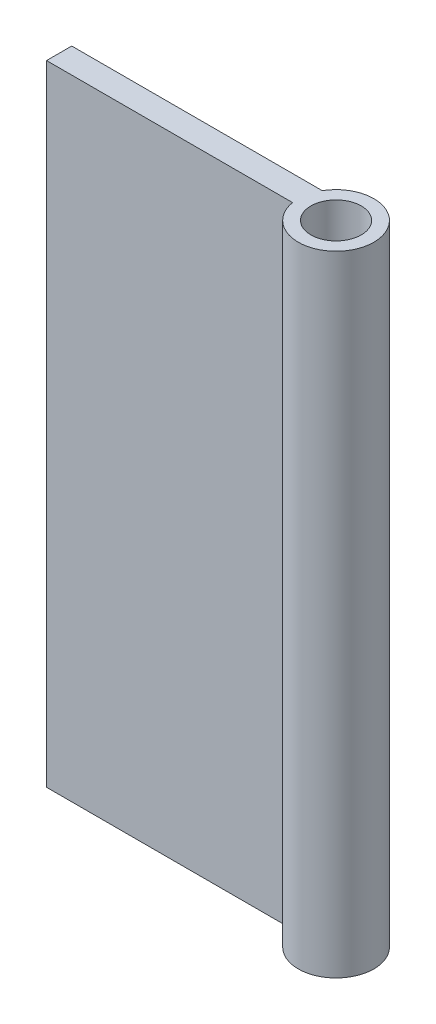
ISO-10303-21;
HEADER;
FILE_DESCRIPTION(('STEP AP214'),'2;1');
FILE_NAME('part.step','',(''),(''),'','','');
FILE_SCHEMA(('AUTOMOTIVE_DESIGN { 1 0 10303 214 1 1 1 1 }'));
ENDSEC;
DATA;
#1=APPLICATION_CONTEXT('core data for automotive mechanical design processes');
#2=APPLICATION_PROTOCOL_DEFINITION('international standard','automotive_design',2000,#1);
#3=PRODUCT_CONTEXT('',#1,'mechanical');
#4=PRODUCT('Part','Part','',(#3));
#5=PRODUCT_RELATED_PRODUCT_CATEGORY('part','',(#4));
#6=PRODUCT_DEFINITION_FORMATION('','',#4);
#7=PRODUCT_DEFINITION_CONTEXT('part definition',#1,'design');
#8=PRODUCT_DEFINITION('design','',#6,#7);
#9=PRODUCT_DEFINITION_SHAPE('','',#8);
#10=(LENGTH_UNIT() NAMED_UNIT(*) SI_UNIT(.MILLI.,.METRE.));
#11=(NAMED_UNIT(*) PLANE_ANGLE_UNIT() SI_UNIT($,.RADIAN.));
#12=(NAMED_UNIT(*) SI_UNIT($,.STERADIAN.) SOLID_ANGLE_UNIT());
#13=UNCERTAINTY_MEASURE_WITH_UNIT(LENGTH_MEASURE(1.E-05),#10,'distance_accuracy_value','');
#14=(GEOMETRIC_REPRESENTATION_CONTEXT(3) GLOBAL_UNCERTAINTY_ASSIGNED_CONTEXT((#13)) GLOBAL_UNIT_ASSIGNED_CONTEXT((#10,
#11,#12)) REPRESENTATION_CONTEXT('',''));
#15=CARTESIAN_POINT('',(0.,0.,0.));
#16=DIRECTION('',(0.,0.,1.));
#17=DIRECTION('',(1.,0.,0.));
#18=AXIS2_PLACEMENT_3D('',#15,#16,#17);
#19=CARTESIAN_POINT('',(-10.,25.,2.));
#20=DIRECTION('',(0.,-1.,0.));
#21=DIRECTION('',(0.,0.,-1.));
#22=AXIS2_PLACEMENT_3D('',#19,#20,#21);
#23=PLANE('',#22);
#24=DIRECTION('',(-1.,0.,0.));
#25=VECTOR('',#24,1.);
#26=CARTESIAN_POINT('',(-10.,25.,2.));
#27=LINE('',#26,#25);
#28=CARTESIAN_POINT('',(9.54196010845019,25.,2.));
#29=VERTEX_POINT('',#28);
#30=CARTESIAN_POINT('',(-10.,25.,2.));
#31=VERTEX_POINT('',#30);
#32=EDGE_CURVE('E90',#29,#31,#27,.T.);
#33=ORIENTED_EDGE('',*,*,#32,.F.);
#34=CARTESIAN_POINT('',(12.5,25.,1.5));
#35=DIRECTION('',(0.,1.,0.));
#36=DIRECTION('',(0.,0.,1.));
#37=AXIS2_PLACEMENT_3D('',#34,#35,#36);
#38=CIRCLE('',#37,3.);
#39=CARTESIAN_POINT('',(9.90192378864668,25.,0.));
#40=VERTEX_POINT('',#39);
#41=EDGE_CURVE('E48',#29,#40,#38,.T.);
#42=ORIENTED_EDGE('',*,*,#41,.T.);
#43=DIRECTION('',(-1.,0.,0.));
#44=VECTOR('',#43,1.);
#45=CARTESIAN_POINT('',(-10.,25.,0.));
#46=LINE('',#45,#44);
#47=CARTESIAN_POINT('',(-10.,25.,0.));
#48=VERTEX_POINT('',#47);
#49=EDGE_CURVE('E78',#40,#48,#46,.T.);
#50=ORIENTED_EDGE('',*,*,#49,.T.);
#51=DIRECTION('',(0.,0.,-1.));
#52=VECTOR('',#51,1.);
#53=CARTESIAN_POINT('',(-10.,25.,2.));
#54=LINE('',#53,#52);
#55=EDGE_CURVE('E41',#31,#48,#54,.T.);
#56=ORIENTED_EDGE('',*,*,#55,.F.);
#57=EDGE_LOOP('',(#33,#42,#50,#56));
#58=FACE_BOUND('',#57,.T.);
#59=CARTESIAN_POINT('',(12.5,25.,1.5));
#60=DIRECTION('',(0.,1.,0.));
#61=DIRECTION('',(0.,0.,1.));
#62=AXIS2_PLACEMENT_3D('',#59,#60,#61);
#63=CIRCLE('',#62,2.);
#64=CARTESIAN_POINT('',(12.5,25.,3.5));
#65=VERTEX_POINT('',#64);
#66=EDGE_CURVE('E105',#65,#65,#63,.T.);
#67=ORIENTED_EDGE('',*,*,#66,.F.);
#68=EDGE_LOOP('',(#67));
#69=FACE_BOUND('',#68,.T.);
#70=ADVANCED_FACE('F34',(#58,#69),#23,.F.);
#71=CARTESIAN_POINT('',(-10.,-25.,2.));
#72=DIRECTION('',(1.,0.,0.));
#73=DIRECTION('',(0.,0.,-1.));
#74=AXIS2_PLACEMENT_3D('',#71,#72,#73);
#75=PLANE('',#74);
#76=DIRECTION('',(0.,-1.,0.));
#77=VECTOR('',#76,1.);
#78=CARTESIAN_POINT('',(-10.,-25.,0.));
#79=LINE('',#78,#77);
#80=CARTESIAN_POINT('',(-10.,-25.,0.));
#81=VERTEX_POINT('',#80);
#82=EDGE_CURVE('E68',#48,#81,#79,.T.);
#83=ORIENTED_EDGE('',*,*,#82,.T.);
#84=DIRECTION('',(0.,0.,-1.));
#85=VECTOR('',#84,1.);
#86=CARTESIAN_POINT('',(-10.,-25.,2.));
#87=LINE('',#86,#85);
#88=CARTESIAN_POINT('',(-10.,-25.,2.));
#89=VERTEX_POINT('',#88);
#90=EDGE_CURVE('E71',#89,#81,#87,.T.);
#91=ORIENTED_EDGE('',*,*,#90,.F.);
#92=DIRECTION('',(0.,-1.,0.));
#93=VECTOR('',#92,1.);
#94=CARTESIAN_POINT('',(-10.,-25.,2.));
#95=LINE('',#94,#93);
#96=EDGE_CURVE('E56',#31,#89,#95,.T.);
#97=ORIENTED_EDGE('',*,*,#96,.F.);
#98=ORIENTED_EDGE('',*,*,#55,.T.);
#99=EDGE_LOOP('',(#83,#91,#97,#98));
#100=FACE_BOUND('',#99,.T.);
#101=ADVANCED_FACE('F70',(#100),#75,.F.);
#102=CARTESIAN_POINT('',(-10.,-25.,2.));
#103=DIRECTION('',(0.,1.,0.));
#104=DIRECTION('',(0.,0.,1.));
#105=AXIS2_PLACEMENT_3D('',#102,#103,#104);
#106=PLANE('',#105);
#107=DIRECTION('',(1.,0.,0.));
#108=VECTOR('',#107,1.);
#109=CARTESIAN_POINT('',(-10.,-25.,0.));
#110=LINE('',#109,#108);
#111=CARTESIAN_POINT('',(9.90192378864668,-25.,0.));
#112=VERTEX_POINT('',#111);
#113=EDGE_CURVE('E77',#81,#112,#110,.T.);
#114=ORIENTED_EDGE('',*,*,#113,.T.);
#115=CARTESIAN_POINT('',(12.5,-25.,1.5));
#116=DIRECTION('',(0.,1.,0.));
#117=DIRECTION('',(0.,0.,1.));
#118=AXIS2_PLACEMENT_3D('',#115,#116,#117);
#119=CIRCLE('',#118,3.);
#120=CARTESIAN_POINT('',(9.54196010845019,-25.,2.));
#121=VERTEX_POINT('',#120);
#122=EDGE_CURVE('E100',#121,#112,#119,.T.);
#123=ORIENTED_EDGE('',*,*,#122,.F.);
#124=DIRECTION('',(1.,0.,0.));
#125=VECTOR('',#124,1.);
#126=CARTESIAN_POINT('',(-10.,-25.,2.));
#127=LINE('',#126,#125);
#128=EDGE_CURVE('E86',#89,#121,#127,.T.);
#129=ORIENTED_EDGE('',*,*,#128,.F.);
#130=ORIENTED_EDGE('',*,*,#90,.T.);
#131=EDGE_LOOP('',(#114,#123,#129,#130));
#132=FACE_BOUND('',#131,.T.);
#133=CARTESIAN_POINT('',(12.5,-25.,1.5));
#134=DIRECTION('',(0.,1.,0.));
#135=DIRECTION('',(0.,0.,1.));
#136=AXIS2_PLACEMENT_3D('',#133,#134,#135);
#137=CIRCLE('',#136,2.);
#138=CARTESIAN_POINT('',(12.5,-25.,3.5));
#139=VERTEX_POINT('',#138);
#140=EDGE_CURVE('E102',#139,#139,#137,.T.);
#141=ORIENTED_EDGE('',*,*,#140,.T.);
#142=EDGE_LOOP('',(#141));
#143=FACE_BOUND('',#142,.T.);
#144=ADVANCED_FACE('F82',(#132,#143),#106,.F.);
#145=CARTESIAN_POINT('',(0.,0.,2.));
#146=DIRECTION('',(0.,0.,-1.));
#147=DIRECTION('',(-1.,0.,0.));
#148=AXIS2_PLACEMENT_3D('',#145,#146,#147);
#149=PLANE('',#148);
#150=ORIENTED_EDGE('',*,*,#128,.T.);
#151=DIRECTION('',(0.,1.,0.));
#152=VECTOR('',#151,1.);
#153=CARTESIAN_POINT('',(9.54196010845019,-25.,2.));
#154=LINE('',#153,#152);
#155=EDGE_CURVE('E95',#121,#29,#154,.T.);
#156=ORIENTED_EDGE('',*,*,#155,.T.);
#157=ORIENTED_EDGE('',*,*,#32,.T.);
#158=ORIENTED_EDGE('',*,*,#96,.T.);
#159=EDGE_LOOP('',(#150,#156,#157,#158));
#160=FACE_BOUND('',#159,.T.);
#161=ADVANCED_FACE('F124',(#160),#149,.F.);
#162=CARTESIAN_POINT('',(0.,0.,0.));
#163=DIRECTION('',(0.,0.,-1.));
#164=DIRECTION('',(-1.,0.,0.));
#165=AXIS2_PLACEMENT_3D('',#162,#163,#164);
#166=PLANE('',#165);
#167=DIRECTION('',(0.,1.,0.));
#168=VECTOR('',#167,1.);
#169=CARTESIAN_POINT('',(9.90192378864668,-25.,0.));
#170=LINE('',#169,#168);
#171=EDGE_CURVE('E11',#112,#40,#170,.T.);
#172=ORIENTED_EDGE('',*,*,#171,.F.);
#173=ORIENTED_EDGE('',*,*,#113,.F.);
#174=ORIENTED_EDGE('',*,*,#82,.F.);
#175=ORIENTED_EDGE('',*,*,#49,.F.);
#176=EDGE_LOOP('',(#172,#173,#174,#175));
#177=FACE_BOUND('',#176,.T.);
#178=ADVANCED_FACE('F89',(#177),#166,.T.);
#179=CARTESIAN_POINT('',(12.5,-25.,1.5));
#180=DIRECTION('',(0.,1.,0.));
#181=DIRECTION('',(0.,0.,1.));
#182=AXIS2_PLACEMENT_3D('',#179,#180,#181);
#183=CYLINDRICAL_SURFACE('',#182,3.);
#184=ORIENTED_EDGE('',*,*,#155,.F.);
#185=ORIENTED_EDGE('',*,*,#122,.T.);
#186=ORIENTED_EDGE('',*,*,#171,.T.);
#187=ORIENTED_EDGE('',*,*,#41,.F.);
#188=EDGE_LOOP('',(#184,#185,#186,#187));
#189=FACE_BOUND('',#188,.T.);
#190=ADVANCED_FACE('F114',(#189),#183,.T.);
#191=CARTESIAN_POINT('',(12.5,-25.,1.5));
#192=DIRECTION('',(0.,1.,0.));
#193=DIRECTION('',(0.,0.,1.));
#194=AXIS2_PLACEMENT_3D('',#191,#192,#193);
#195=CYLINDRICAL_SURFACE('',#194,2.);
#196=ORIENTED_EDGE('',*,*,#140,.F.);
#197=EDGE_LOOP('',(#196));
#198=FACE_BOUND('',#197,.T.);
#199=ORIENTED_EDGE('',*,*,#66,.T.);
#200=EDGE_LOOP('',(#199));
#201=FACE_BOUND('',#200,.T.);
#202=ADVANCED_FACE('F111',(#198,#201),#195,.F.);
#203=CLOSED_SHELL('',(#70,#101,#144,#161,#178,#190,#202));
#204=MANIFOLD_SOLID_BREP('B2',#203);
#205=ADVANCED_BREP_SHAPE_REPRESENTATION('',(#18,#204),#14);
#206=SHAPE_DEFINITION_REPRESENTATION(#9,#205);
ENDSEC;
END-ISO-10303-21;
